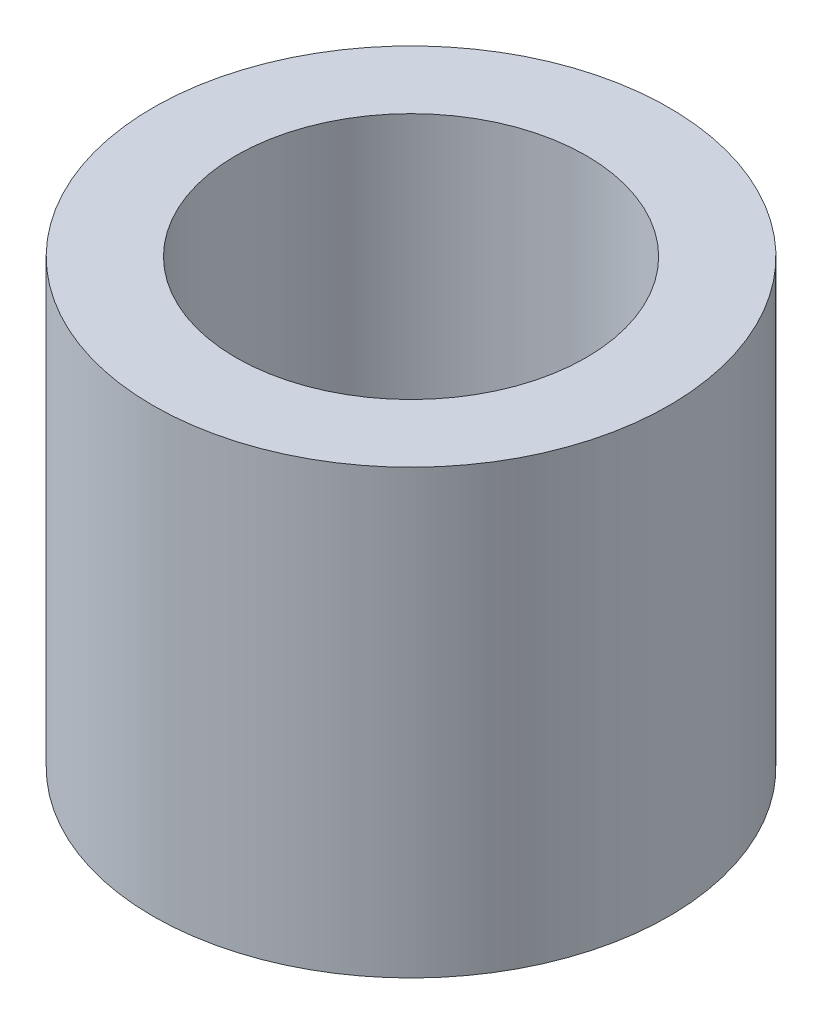
ISO-10303-21;
HEADER;
FILE_DESCRIPTION(('STEP AP214'),'2;1');
FILE_NAME('part.step','',(''),(''),'','','');
FILE_SCHEMA(('AUTOMOTIVE_DESIGN { 1 0 10303 214 1 1 1 1 }'));
ENDSEC;
DATA;
#1=APPLICATION_CONTEXT('core data for automotive mechanical design processes');
#2=APPLICATION_PROTOCOL_DEFINITION('international standard','automotive_design',2000,#1);
#3=PRODUCT_CONTEXT('',#1,'mechanical');
#4=PRODUCT('Part','Part','',(#3));
#5=PRODUCT_RELATED_PRODUCT_CATEGORY('part','',(#4));
#6=PRODUCT_DEFINITION_FORMATION('','',#4);
#7=PRODUCT_DEFINITION_CONTEXT('part definition',#1,'design');
#8=PRODUCT_DEFINITION('design','',#6,#7);
#9=PRODUCT_DEFINITION_SHAPE('','',#8);
#10=(LENGTH_UNIT() NAMED_UNIT(*) SI_UNIT(.MILLI.,.METRE.));
#11=(NAMED_UNIT(*) PLANE_ANGLE_UNIT() SI_UNIT($,.RADIAN.));
#12=(NAMED_UNIT(*) SI_UNIT($,.STERADIAN.) SOLID_ANGLE_UNIT());
#13=UNCERTAINTY_MEASURE_WITH_UNIT(LENGTH_MEASURE(1.E-05),#10,'distance_accuracy_value','');
#14=(GEOMETRIC_REPRESENTATION_CONTEXT(3) GLOBAL_UNCERTAINTY_ASSIGNED_CONTEXT((#13)) GLOBAL_UNIT_ASSIGNED_CONTEXT((#10,
#11,#12)) REPRESENTATION_CONTEXT('',''));
#15=CARTESIAN_POINT('',(0.,0.,0.));
#16=DIRECTION('',(0.,0.,1.));
#17=DIRECTION('',(1.,0.,0.));
#18=AXIS2_PLACEMENT_3D('',#15,#16,#17);
#19=CARTESIAN_POINT('',(0.,76.2,0.));
#20=DIRECTION('',(0.,1.,0.));
#21=DIRECTION('',(0.,0.,1.));
#22=AXIS2_PLACEMENT_3D('',#19,#20,#21);
#23=PLANE('',#22);
#24=CARTESIAN_POINT('',(0.,76.2,0.));
#25=DIRECTION('',(0.,1.,0.));
#26=DIRECTION('',(0.,0.,1.));
#27=AXIS2_PLACEMENT_3D('',#24,#25,#26);
#28=CIRCLE('',#27,44.45);
#29=CARTESIAN_POINT('',(0.,76.2,44.45));
#30=VERTEX_POINT('',#29);
#31=EDGE_CURVE('E10',#30,#30,#28,.T.);
#32=ORIENTED_EDGE('',*,*,#31,.T.);
#33=EDGE_LOOP('',(#32));
#34=FACE_BOUND('',#33,.T.);
#35=CARTESIAN_POINT('',(0.,76.2,0.));
#36=DIRECTION('',(0.,1.,0.));
#37=DIRECTION('',(0.,0.,1.));
#38=AXIS2_PLACEMENT_3D('',#35,#36,#37);
#39=CIRCLE('',#38,30.1625);
#40=CARTESIAN_POINT('',(0.,76.2,30.1625));
#41=VERTEX_POINT('',#40);
#42=EDGE_CURVE('E50',#41,#41,#39,.T.);
#43=ORIENTED_EDGE('',*,*,#42,.F.);
#44=EDGE_LOOP('',(#43));
#45=FACE_BOUND('',#44,.T.);
#46=ADVANCED_FACE('F37',(#34,#45),#23,.T.);
#47=CARTESIAN_POINT('',(0.,0.,0.));
#48=DIRECTION('',(0.,1.,0.));
#49=DIRECTION('',(0.,0.,1.));
#50=AXIS2_PLACEMENT_3D('',#47,#48,#49);
#51=PLANE('',#50);
#52=CARTESIAN_POINT('',(0.,0.,0.));
#53=DIRECTION('',(0.,1.,0.));
#54=DIRECTION('',(0.,0.,1.));
#55=AXIS2_PLACEMENT_3D('',#52,#53,#54);
#56=CIRCLE('',#55,44.45);
#57=CARTESIAN_POINT('',(0.,0.,44.45));
#58=VERTEX_POINT('',#57);
#59=EDGE_CURVE('E41',#58,#58,#56,.T.);
#60=ORIENTED_EDGE('',*,*,#59,.F.);
#61=EDGE_LOOP('',(#60));
#62=FACE_BOUND('',#61,.T.);
#63=CARTESIAN_POINT('',(0.,0.,0.));
#64=DIRECTION('',(0.,1.,0.));
#65=DIRECTION('',(0.,0.,1.));
#66=AXIS2_PLACEMENT_3D('',#63,#64,#65);
#67=CIRCLE('',#66,30.1625);
#68=CARTESIAN_POINT('',(0.,0.,30.1625));
#69=VERTEX_POINT('',#68);
#70=EDGE_CURVE('E52',#69,#69,#67,.T.);
#71=ORIENTED_EDGE('',*,*,#70,.T.);
#72=EDGE_LOOP('',(#71));
#73=FACE_BOUND('',#72,.T.);
#74=ADVANCED_FACE('F64',(#62,#73),#51,.F.);
#75=CARTESIAN_POINT('',(0.,76.2,0.));
#76=DIRECTION('',(0.,-1.,0.));
#77=DIRECTION('',(0.,0.,-1.));
#78=AXIS2_PLACEMENT_3D('',#75,#76,#77);
#79=CYLINDRICAL_SURFACE('',#78,44.45);
#80=ORIENTED_EDGE('',*,*,#31,.F.);
#81=EDGE_LOOP('',(#80));
#82=FACE_BOUND('',#81,.T.);
#83=ORIENTED_EDGE('',*,*,#59,.T.);
#84=EDGE_LOOP('',(#83));
#85=FACE_BOUND('',#84,.T.);
#86=ADVANCED_FACE('F39',(#82,#85),#79,.T.);
#87=CARTESIAN_POINT('',(0.,76.2,0.));
#88=DIRECTION('',(0.,-1.,0.));
#89=DIRECTION('',(0.,0.,-1.));
#90=AXIS2_PLACEMENT_3D('',#87,#88,#89);
#91=CYLINDRICAL_SURFACE('',#90,30.1625);
#92=ORIENTED_EDGE('',*,*,#42,.T.);
#93=EDGE_LOOP('',(#92));
#94=FACE_BOUND('',#93,.T.);
#95=ORIENTED_EDGE('',*,*,#70,.F.);
#96=EDGE_LOOP('',(#95));
#97=FACE_BOUND('',#96,.T.);
#98=ADVANCED_FACE('F60',(#94,#97),#91,.F.);
#99=CLOSED_SHELL('',(#46,#74,#86,#98));
#100=MANIFOLD_SOLID_BREP('B2',#99);
#101=ADVANCED_BREP_SHAPE_REPRESENTATION('',(#18,#100),#14);
#102=SHAPE_DEFINITION_REPRESENTATION(#9,#101);
ENDSEC;
END-ISO-10303-21;
